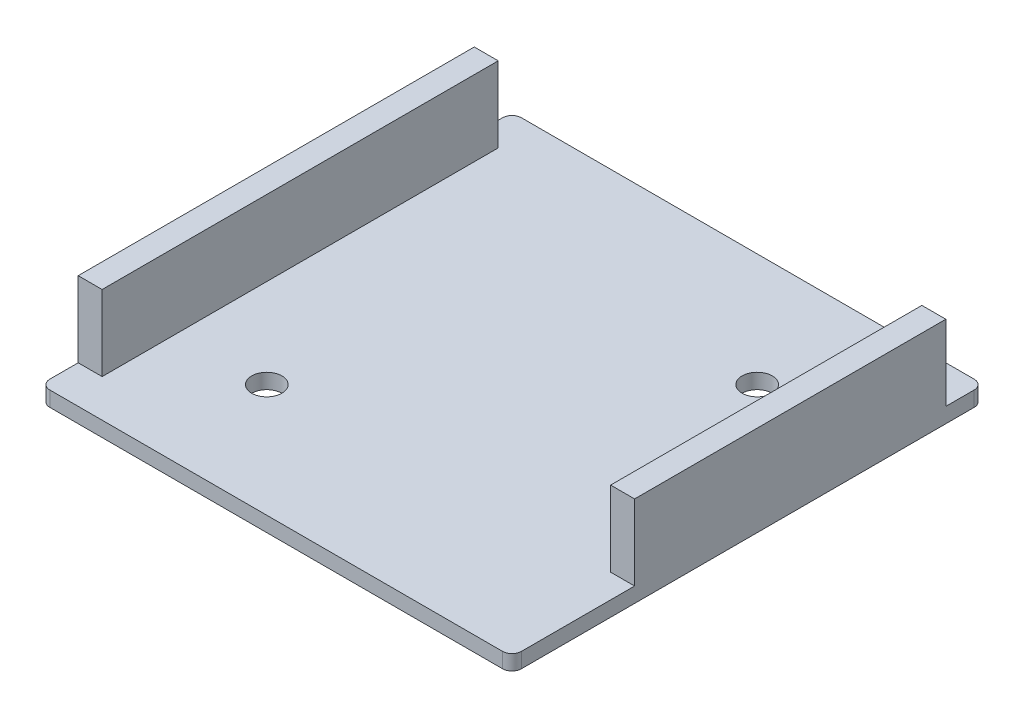
ISO-10303-21;
HEADER;
FILE_DESCRIPTION(('STEP AP214'),'2;1');
FILE_NAME('part.step','',(''),(''),'','','');
FILE_SCHEMA(('AUTOMOTIVE_DESIGN { 1 0 10303 214 1 1 1 1 }'));
ENDSEC;
DATA;
#1=APPLICATION_CONTEXT('core data for automotive mechanical design processes');
#2=APPLICATION_PROTOCOL_DEFINITION('international standard','automotive_design',2000,#1);
#3=PRODUCT_CONTEXT('',#1,'mechanical');
#4=PRODUCT('Part','Part','',(#3));
#5=PRODUCT_RELATED_PRODUCT_CATEGORY('part','',(#4));
#6=PRODUCT_DEFINITION_FORMATION('','',#4);
#7=PRODUCT_DEFINITION_CONTEXT('part definition',#1,'design');
#8=PRODUCT_DEFINITION('design','',#6,#7);
#9=PRODUCT_DEFINITION_SHAPE('','',#8);
#10=(LENGTH_UNIT() NAMED_UNIT(*) SI_UNIT(.MILLI.,.METRE.));
#11=(NAMED_UNIT(*) PLANE_ANGLE_UNIT() SI_UNIT($,.RADIAN.));
#12=(NAMED_UNIT(*) SI_UNIT($,.STERADIAN.) SOLID_ANGLE_UNIT());
#13=UNCERTAINTY_MEASURE_WITH_UNIT(LENGTH_MEASURE(1.E-05),#10,'distance_accuracy_value','');
#14=(GEOMETRIC_REPRESENTATION_CONTEXT(3) GLOBAL_UNCERTAINTY_ASSIGNED_CONTEXT((#13)) GLOBAL_UNIT_ASSIGNED_CONTEXT((#10,
#11,#12)) REPRESENTATION_CONTEXT('',''));
#15=CARTESIAN_POINT('',(0.,0.,0.));
#16=DIRECTION('',(0.,0.,1.));
#17=DIRECTION('',(1.,0.,0.));
#18=AXIS2_PLACEMENT_3D('',#15,#16,#17);
#19=CARTESIAN_POINT('',(0.,1.6,0.));
#20=DIRECTION('',(0.,-1.,0.));
#21=DIRECTION('',(0.,0.,-1.));
#22=AXIS2_PLACEMENT_3D('',#19,#20,#21);
#23=PLANE('',#22);
#24=CARTESIAN_POINT('',(13.,1.6,-13.));
#25=DIRECTION('',(0.,1.,0.));
#26=DIRECTION('',(0.,0.,1.));
#27=AXIS2_PLACEMENT_3D('',#24,#25,#26);
#28=CIRCLE('',#27,1.6);
#29=CARTESIAN_POINT('',(13.,1.6,-11.4));
#30=VERTEX_POINT('',#29);
#31=EDGE_CURVE('E216',#30,#30,#28,.T.);
#32=ORIENTED_EDGE('',*,*,#31,.F.);
#33=EDGE_LOOP('',(#32));
#34=FACE_BOUND('',#33,.T.);
#35=CARTESIAN_POINT('',(-13.,1.6,13.));
#36=DIRECTION('',(0.,1.,0.));
#37=DIRECTION('',(0.,0.,1.));
#38=AXIS2_PLACEMENT_3D('',#35,#36,#37);
#39=CIRCLE('',#38,1.6);
#40=CARTESIAN_POINT('',(-13.,1.6,14.6));
#41=VERTEX_POINT('',#40);
#42=EDGE_CURVE('E221',#41,#41,#39,.T.);
#43=ORIENTED_EDGE('',*,*,#42,.F.);
#44=EDGE_LOOP('',(#43));
#45=FACE_BOUND('',#44,.T.);
#46=DIRECTION('',(1.,0.,0.));
#47=VECTOR('',#46,1.);
#48=CARTESIAN_POINT('',(22.46,1.6,12.));
#49=LINE('',#48,#47);
#50=CARTESIAN_POINT('',(22.46,1.6,12.));
#51=VERTEX_POINT('',#50);
#52=CARTESIAN_POINT('',(25.,1.6,12.));
#53=VERTEX_POINT('',#52);
#54=EDGE_CURVE('E50',#51,#53,#49,.T.);
#55=ORIENTED_EDGE('',*,*,#54,.F.);
#56=DIRECTION('',(0.,0.,1.));
#57=VECTOR('',#56,1.);
#58=CARTESIAN_POINT('',(22.46,1.6,-21.));
#59=LINE('',#58,#57);
#60=CARTESIAN_POINT('',(22.46,1.6,-21.));
#61=VERTEX_POINT('',#60);
#62=EDGE_CURVE('E55',#61,#51,#59,.T.);
#63=ORIENTED_EDGE('',*,*,#62,.F.);
#64=DIRECTION('',(-1.,0.,0.));
#65=VECTOR('',#64,1.);
#66=CARTESIAN_POINT('',(22.46,1.6,-21.));
#67=LINE('',#66,#65);
#68=CARTESIAN_POINT('',(25.,1.6,-21.));
#69=VERTEX_POINT('',#68);
#70=EDGE_CURVE('E166',#69,#61,#67,.T.);
#71=ORIENTED_EDGE('',*,*,#70,.F.);
#72=DIRECTION('',(0.,0.,-1.));
#73=VECTOR('',#72,1.);
#74=CARTESIAN_POINT('',(25.,1.6,-25.));
#75=LINE('',#74,#73);
#76=CARTESIAN_POINT('',(25.,1.6,-24.));
#77=VERTEX_POINT('',#76);
#78=EDGE_CURVE('E288',#69,#77,#75,.T.);
#79=ORIENTED_EDGE('',*,*,#78,.T.);
#80=CARTESIAN_POINT('',(24.,1.6,-24.));
#81=DIRECTION('',(0.,-1.,0.));
#82=DIRECTION('',(0.,0.,-1.));
#83=AXIS2_PLACEMENT_3D('',#80,#81,#82);
#84=CIRCLE('',#83,1.);
#85=CARTESIAN_POINT('',(24.,1.6,-25.));
#86=VERTEX_POINT('',#85);
#87=EDGE_CURVE('E249',#77,#86,#84,.F.);
#88=ORIENTED_EDGE('',*,*,#87,.T.);
#89=DIRECTION('',(-1.,0.,0.));
#90=VECTOR('',#89,1.);
#91=CARTESIAN_POINT('',(25.,1.6,-25.));
#92=LINE('',#91,#90);
#93=CARTESIAN_POINT('',(-24.,1.6,-25.));
#94=VERTEX_POINT('',#93);
#95=EDGE_CURVE('E274',#86,#94,#92,.T.);
#96=ORIENTED_EDGE('',*,*,#95,.T.);
#97=CARTESIAN_POINT('',(-24.,1.6,-24.));
#98=DIRECTION('',(0.,-1.,0.));
#99=DIRECTION('',(0.,0.,-1.));
#100=AXIS2_PLACEMENT_3D('',#97,#98,#99);
#101=CIRCLE('',#100,1.);
#102=CARTESIAN_POINT('',(-25.,1.6,-24.));
#103=VERTEX_POINT('',#102);
#104=EDGE_CURVE('E251',#94,#103,#101,.F.);
#105=ORIENTED_EDGE('',*,*,#104,.T.);
#106=DIRECTION('',(0.,0.,1.));
#107=VECTOR('',#106,1.);
#108=CARTESIAN_POINT('',(-25.,1.6,-25.));
#109=LINE('',#108,#107);
#110=CARTESIAN_POINT('',(-25.,1.6,-21.));
#111=VERTEX_POINT('',#110);
#112=EDGE_CURVE('E238',#103,#111,#109,.T.);
#113=ORIENTED_EDGE('',*,*,#112,.T.);
#114=DIRECTION('',(-1.,0.,0.));
#115=VECTOR('',#114,1.);
#116=CARTESIAN_POINT('',(-25.,1.6,-21.));
#117=LINE('',#116,#115);
#118=CARTESIAN_POINT('',(-22.46,1.6,-21.));
#119=VERTEX_POINT('',#118);
#120=EDGE_CURVE('E182',#119,#111,#117,.T.);
#121=ORIENTED_EDGE('',*,*,#120,.F.);
#122=DIRECTION('',(0.,0.,-1.));
#123=VECTOR('',#122,1.);
#124=CARTESIAN_POINT('',(-22.46,1.6,-21.));
#125=LINE('',#124,#123);
#126=CARTESIAN_POINT('',(-22.46,1.6,21.));
#127=VERTEX_POINT('',#126);
#128=EDGE_CURVE('E172',#127,#119,#125,.T.);
#129=ORIENTED_EDGE('',*,*,#128,.F.);
#130=DIRECTION('',(1.,0.,0.));
#131=VECTOR('',#130,1.);
#132=CARTESIAN_POINT('',(-25.,1.6,21.));
#133=LINE('',#132,#131);
#134=CARTESIAN_POINT('',(-25.,1.6,21.));
#135=VERTEX_POINT('',#134);
#136=EDGE_CURVE('E169',#135,#127,#133,.T.);
#137=ORIENTED_EDGE('',*,*,#136,.F.);
#138=CARTESIAN_POINT('',(-25.,1.6,24.));
#139=VERTEX_POINT('',#138);
#140=EDGE_CURVE('E236',#135,#139,#109,.T.);
#141=ORIENTED_EDGE('',*,*,#140,.T.);
#142=CARTESIAN_POINT('',(-24.,1.6,24.));
#143=DIRECTION('',(0.,-1.,0.));
#144=DIRECTION('',(0.,0.,-1.));
#145=AXIS2_PLACEMENT_3D('',#142,#143,#144);
#146=CIRCLE('',#145,1.);
#147=CARTESIAN_POINT('',(-24.,1.6,25.));
#148=VERTEX_POINT('',#147);
#149=EDGE_CURVE('E253',#139,#148,#146,.F.);
#150=ORIENTED_EDGE('',*,*,#149,.T.);
#151=DIRECTION('',(1.,0.,0.));
#152=VECTOR('',#151,1.);
#153=CARTESIAN_POINT('',(25.,1.6,25.));
#154=LINE('',#153,#152);
#155=CARTESIAN_POINT('',(24.,1.6,25.));
#156=VERTEX_POINT('',#155);
#157=EDGE_CURVE('E232',#148,#156,#154,.T.);
#158=ORIENTED_EDGE('',*,*,#157,.T.);
#159=CARTESIAN_POINT('',(24.,1.6,24.));
#160=DIRECTION('',(0.,-1.,0.));
#161=DIRECTION('',(0.,0.,-1.));
#162=AXIS2_PLACEMENT_3D('',#159,#160,#161);
#163=CIRCLE('',#162,1.);
#164=CARTESIAN_POINT('',(25.,1.6,24.));
#165=VERTEX_POINT('',#164);
#166=EDGE_CURVE('E247',#156,#165,#163,.F.);
#167=ORIENTED_EDGE('',*,*,#166,.T.);
#168=EDGE_CURVE('E287',#165,#53,#75,.T.);
#169=ORIENTED_EDGE('',*,*,#168,.T.);
#170=EDGE_LOOP('',(#55,#63,#71,#79,#88,#96,#105,#113,#121,#129,#137,#141,#150,#158,#167,#169));
#171=FACE_BOUND('',#170,.T.);
#172=ADVANCED_FACE('F33',(#34,#45,#171),#23,.F.);
#173=CARTESIAN_POINT('',(-25.,1.6,-25.));
#174=DIRECTION('',(1.,0.,0.));
#175=DIRECTION('',(0.,0.,-1.));
#176=AXIS2_PLACEMENT_3D('',#173,#174,#175);
#177=PLANE('',#176);
#178=ORIENTED_EDGE('',*,*,#112,.F.);
#179=DIRECTION('',(0.,-1.,0.));
#180=VECTOR('',#179,1.);
#181=CARTESIAN_POINT('',(-25.,1.6,-24.));
#182=LINE('',#181,#180);
#183=CARTESIAN_POINT('',(-25.,0.,-24.));
#184=VERTEX_POINT('',#183);
#185=EDGE_CURVE('E11',#103,#184,#182,.T.);
#186=ORIENTED_EDGE('',*,*,#185,.T.);
#187=DIRECTION('',(0.,0.,1.));
#188=VECTOR('',#187,1.);
#189=CARTESIAN_POINT('',(-25.,0.,-25.));
#190=LINE('',#189,#188);
#191=CARTESIAN_POINT('',(-25.,0.,24.));
#192=VERTEX_POINT('',#191);
#193=EDGE_CURVE('E227',#184,#192,#190,.T.);
#194=ORIENTED_EDGE('',*,*,#193,.T.);
#195=DIRECTION('',(0.,-1.,0.));
#196=VECTOR('',#195,1.);
#197=CARTESIAN_POINT('',(-25.,1.6,24.));
#198=LINE('',#197,#196);
#199=EDGE_CURVE('E42',#192,#139,#198,.F.);
#200=ORIENTED_EDGE('',*,*,#199,.T.);
#201=ORIENTED_EDGE('',*,*,#140,.F.);
#202=DIRECTION('',(0.,-1.,0.));
#203=VECTOR('',#202,1.);
#204=CARTESIAN_POINT('',(-25.,9.6,21.));
#205=LINE('',#204,#203);
#206=CARTESIAN_POINT('',(-25.,9.6,21.));
#207=VERTEX_POINT('',#206);
#208=EDGE_CURVE('E211',#207,#135,#205,.T.);
#209=ORIENTED_EDGE('',*,*,#208,.F.);
#210=DIRECTION('',(0.,0.,1.));
#211=VECTOR('',#210,1.);
#212=CARTESIAN_POINT('',(-25.,9.6,-21.));
#213=LINE('',#212,#211);
#214=CARTESIAN_POINT('',(-25.,9.6,-21.));
#215=VERTEX_POINT('',#214);
#216=EDGE_CURVE('E178',#215,#207,#213,.T.);
#217=ORIENTED_EDGE('',*,*,#216,.F.);
#218=DIRECTION('',(0.,-1.,0.));
#219=VECTOR('',#218,1.);
#220=CARTESIAN_POINT('',(-25.,9.6,-21.));
#221=LINE('',#220,#219);
#222=EDGE_CURVE('E188',#215,#111,#221,.T.);
#223=ORIENTED_EDGE('',*,*,#222,.T.);
#224=EDGE_LOOP('',(#178,#186,#194,#200,#201,#209,#217,#223));
#225=FACE_BOUND('',#224,.T.);
#226=ADVANCED_FACE('F321',(#225),#177,.F.);
#227=CARTESIAN_POINT('',(25.,1.6,25.));
#228=DIRECTION('',(0.,0.,-1.));
#229=DIRECTION('',(-1.,0.,0.));
#230=AXIS2_PLACEMENT_3D('',#227,#228,#229);
#231=PLANE('',#230);
#232=DIRECTION('',(1.,0.,0.));
#233=VECTOR('',#232,1.);
#234=CARTESIAN_POINT('',(25.,0.,25.));
#235=LINE('',#234,#233);
#236=CARTESIAN_POINT('',(-24.,0.,25.));
#237=VERTEX_POINT('',#236);
#238=CARTESIAN_POINT('',(24.,0.,25.));
#239=VERTEX_POINT('',#238);
#240=EDGE_CURVE('E281',#237,#239,#235,.T.);
#241=ORIENTED_EDGE('',*,*,#240,.T.);
#242=DIRECTION('',(0.,-1.,0.));
#243=VECTOR('',#242,1.);
#244=CARTESIAN_POINT('',(24.,1.6,25.));
#245=LINE('',#244,#243);
#246=EDGE_CURVE('E255',#239,#156,#245,.F.);
#247=ORIENTED_EDGE('',*,*,#246,.T.);
#248=ORIENTED_EDGE('',*,*,#157,.F.);
#249=DIRECTION('',(0.,-1.,0.));
#250=VECTOR('',#249,1.);
#251=CARTESIAN_POINT('',(-24.,1.6,25.));
#252=LINE('',#251,#250);
#253=EDGE_CURVE('E257',#148,#237,#252,.T.);
#254=ORIENTED_EDGE('',*,*,#253,.T.);
#255=EDGE_LOOP('',(#241,#247,#248,#254));
#256=FACE_BOUND('',#255,.T.);
#257=ADVANCED_FACE('F324',(#256),#231,.F.);
#258=CARTESIAN_POINT('',(25.,1.6,-25.));
#259=DIRECTION('',(-1.,0.,0.));
#260=DIRECTION('',(0.,0.,1.));
#261=AXIS2_PLACEMENT_3D('',#258,#259,#260);
#262=PLANE('',#261);
#263=ORIENTED_EDGE('',*,*,#168,.F.);
#264=DIRECTION('',(0.,-1.,0.));
#265=VECTOR('',#264,1.);
#266=CARTESIAN_POINT('',(25.,1.6,24.));
#267=LINE('',#266,#265);
#268=CARTESIAN_POINT('',(25.,0.,24.));
#269=VERTEX_POINT('',#268);
#270=EDGE_CURVE('E268',#165,#269,#267,.T.);
#271=ORIENTED_EDGE('',*,*,#270,.T.);
#272=DIRECTION('',(0.,0.,-1.));
#273=VECTOR('',#272,1.);
#274=CARTESIAN_POINT('',(25.,0.,-25.));
#275=LINE('',#274,#273);
#276=CARTESIAN_POINT('',(25.,0.,-24.));
#277=VERTEX_POINT('',#276);
#278=EDGE_CURVE('E278',#269,#277,#275,.T.);
#279=ORIENTED_EDGE('',*,*,#278,.T.);
#280=DIRECTION('',(0.,-1.,0.));
#281=VECTOR('',#280,1.);
#282=CARTESIAN_POINT('',(25.,1.6,-24.));
#283=LINE('',#282,#281);
#284=EDGE_CURVE('E271',#277,#77,#283,.F.);
#285=ORIENTED_EDGE('',*,*,#284,.T.);
#286=ORIENTED_EDGE('',*,*,#78,.F.);
#287=DIRECTION('',(0.,-1.,0.));
#288=VECTOR('',#287,1.);
#289=CARTESIAN_POINT('',(25.,9.6,-21.));
#290=LINE('',#289,#288);
#291=CARTESIAN_POINT('',(25.,9.6,-21.));
#292=VERTEX_POINT('',#291);
#293=EDGE_CURVE('E174',#292,#69,#290,.T.);
#294=ORIENTED_EDGE('',*,*,#293,.F.);
#295=DIRECTION('',(0.,0.,-1.));
#296=VECTOR('',#295,1.);
#297=CARTESIAN_POINT('',(25.,9.6,-21.));
#298=LINE('',#297,#296);
#299=CARTESIAN_POINT('',(25.,9.6,12.));
#300=VERTEX_POINT('',#299);
#301=EDGE_CURVE('E156',#300,#292,#298,.T.);
#302=ORIENTED_EDGE('',*,*,#301,.F.);
#303=DIRECTION('',(0.,-1.,0.));
#304=VECTOR('',#303,1.);
#305=CARTESIAN_POINT('',(25.,9.6,12.));
#306=LINE('',#305,#304);
#307=EDGE_CURVE('E153',#300,#53,#306,.T.);
#308=ORIENTED_EDGE('',*,*,#307,.T.);
#309=EDGE_LOOP('',(#263,#271,#279,#285,#286,#294,#302,#308));
#310=FACE_BOUND('',#309,.T.);
#311=ADVANCED_FACE('F302',(#310),#262,.F.);
#312=CARTESIAN_POINT('',(25.,1.6,-25.));
#313=DIRECTION('',(0.,0.,1.));
#314=DIRECTION('',(1.,0.,0.));
#315=AXIS2_PLACEMENT_3D('',#312,#313,#314);
#316=PLANE('',#315);
#317=ORIENTED_EDGE('',*,*,#95,.F.);
#318=DIRECTION('',(0.,-1.,0.));
#319=VECTOR('',#318,1.);
#320=CARTESIAN_POINT('',(24.,1.6,-25.));
#321=LINE('',#320,#319);
#322=CARTESIAN_POINT('',(24.,0.,-25.));
#323=VERTEX_POINT('',#322);
#324=EDGE_CURVE('E242',#86,#323,#321,.T.);
#325=ORIENTED_EDGE('',*,*,#324,.T.);
#326=DIRECTION('',(-1.,0.,0.));
#327=VECTOR('',#326,1.);
#328=CARTESIAN_POINT('',(25.,0.,-25.));
#329=LINE('',#328,#327);
#330=CARTESIAN_POINT('',(-24.,0.,-25.));
#331=VERTEX_POINT('',#330);
#332=EDGE_CURVE('E275',#323,#331,#329,.T.);
#333=ORIENTED_EDGE('',*,*,#332,.T.);
#334=DIRECTION('',(0.,-1.,0.));
#335=VECTOR('',#334,1.);
#336=CARTESIAN_POINT('',(-24.,1.6,-25.));
#337=LINE('',#336,#335);
#338=EDGE_CURVE('E245',#331,#94,#337,.F.);
#339=ORIENTED_EDGE('',*,*,#338,.T.);
#340=EDGE_LOOP('',(#317,#325,#333,#339));
#341=FACE_BOUND('',#340,.T.);
#342=ADVANCED_FACE('F314',(#341),#316,.F.);
#343=CARTESIAN_POINT('',(0.,0.,0.));
#344=DIRECTION('',(0.,-1.,0.));
#345=DIRECTION('',(0.,0.,-1.));
#346=AXIS2_PLACEMENT_3D('',#343,#344,#345);
#347=PLANE('',#346);
#348=CARTESIAN_POINT('',(13.,0.,-13.));
#349=DIRECTION('',(0.,1.,0.));
#350=DIRECTION('',(0.,0.,1.));
#351=AXIS2_PLACEMENT_3D('',#348,#349,#350);
#352=CIRCLE('',#351,1.6);
#353=CARTESIAN_POINT('',(13.,0.,-11.4));
#354=VERTEX_POINT('',#353);
#355=EDGE_CURVE('E218',#354,#354,#352,.T.);
#356=ORIENTED_EDGE('',*,*,#355,.T.);
#357=EDGE_LOOP('',(#356));
#358=FACE_BOUND('',#357,.T.);
#359=CARTESIAN_POINT('',(-13.,0.,13.));
#360=DIRECTION('',(0.,1.,0.));
#361=DIRECTION('',(0.,0.,1.));
#362=AXIS2_PLACEMENT_3D('',#359,#360,#361);
#363=CIRCLE('',#362,1.6);
#364=CARTESIAN_POINT('',(-13.,0.,14.6));
#365=VERTEX_POINT('',#364);
#366=EDGE_CURVE('E224',#365,#365,#363,.T.);
#367=ORIENTED_EDGE('',*,*,#366,.T.);
#368=EDGE_LOOP('',(#367));
#369=FACE_BOUND('',#368,.T.);
#370=ORIENTED_EDGE('',*,*,#278,.F.);
#371=CARTESIAN_POINT('',(24.,0.,24.));
#372=DIRECTION('',(0.,-1.,0.));
#373=DIRECTION('',(0.,0.,-1.));
#374=AXIS2_PLACEMENT_3D('',#371,#372,#373);
#375=CIRCLE('',#374,1.);
#376=EDGE_CURVE('E260',#269,#239,#375,.T.);
#377=ORIENTED_EDGE('',*,*,#376,.T.);
#378=ORIENTED_EDGE('',*,*,#240,.F.);
#379=CARTESIAN_POINT('',(-24.,0.,24.));
#380=DIRECTION('',(0.,-1.,0.));
#381=DIRECTION('',(0.,0.,-1.));
#382=AXIS2_PLACEMENT_3D('',#379,#380,#381);
#383=CIRCLE('',#382,1.);
#384=EDGE_CURVE('E266',#237,#192,#383,.T.);
#385=ORIENTED_EDGE('',*,*,#384,.T.);
#386=ORIENTED_EDGE('',*,*,#193,.F.);
#387=CARTESIAN_POINT('',(-24.,0.,-24.));
#388=DIRECTION('',(0.,-1.,0.));
#389=DIRECTION('',(0.,0.,-1.));
#390=AXIS2_PLACEMENT_3D('',#387,#388,#389);
#391=CIRCLE('',#390,1.);
#392=EDGE_CURVE('E264',#184,#331,#391,.T.);
#393=ORIENTED_EDGE('',*,*,#392,.T.);
#394=ORIENTED_EDGE('',*,*,#332,.F.);
#395=CARTESIAN_POINT('',(24.,0.,-24.));
#396=DIRECTION('',(0.,-1.,0.));
#397=DIRECTION('',(0.,0.,-1.));
#398=AXIS2_PLACEMENT_3D('',#395,#396,#397);
#399=CIRCLE('',#398,1.);
#400=EDGE_CURVE('E262',#323,#277,#399,.T.);
#401=ORIENTED_EDGE('',*,*,#400,.T.);
#402=EDGE_LOOP('',(#370,#377,#378,#385,#386,#393,#394,#401));
#403=FACE_BOUND('',#402,.T.);
#404=ADVANCED_FACE('F305',(#358,#369,#403),#347,.T.);
#405=CARTESIAN_POINT('',(-13.,0.,13.));
#406=DIRECTION('',(0.,1.,0.));
#407=DIRECTION('',(0.,0.,1.));
#408=AXIS2_PLACEMENT_3D('',#405,#406,#407);
#409=CYLINDRICAL_SURFACE('',#408,1.6);
#410=ORIENTED_EDGE('',*,*,#366,.F.);
#411=EDGE_LOOP('',(#410));
#412=FACE_BOUND('',#411,.T.);
#413=ORIENTED_EDGE('',*,*,#42,.T.);
#414=EDGE_LOOP('',(#413));
#415=FACE_BOUND('',#414,.T.);
#416=ADVANCED_FACE('F342',(#412,#415),#409,.F.);
#417=CARTESIAN_POINT('',(13.,0.,-13.));
#418=DIRECTION('',(0.,1.,0.));
#419=DIRECTION('',(0.,0.,1.));
#420=AXIS2_PLACEMENT_3D('',#417,#418,#419);
#421=CYLINDRICAL_SURFACE('',#420,1.6);
#422=ORIENTED_EDGE('',*,*,#355,.F.);
#423=EDGE_LOOP('',(#422));
#424=FACE_BOUND('',#423,.T.);
#425=ORIENTED_EDGE('',*,*,#31,.T.);
#426=EDGE_LOOP('',(#425));
#427=FACE_BOUND('',#426,.T.);
#428=ADVANCED_FACE('F363',(#424,#427),#421,.F.);
#429=CARTESIAN_POINT('',(24.,1.6,24.));
#430=DIRECTION('',(0.,-1.,0.));
#431=DIRECTION('',(0.,0.,-1.));
#432=AXIS2_PLACEMENT_3D('',#429,#430,#431);
#433=CYLINDRICAL_SURFACE('',#432,1.);
#434=ORIENTED_EDGE('',*,*,#166,.F.);
#435=ORIENTED_EDGE('',*,*,#246,.F.);
#436=ORIENTED_EDGE('',*,*,#376,.F.);
#437=ORIENTED_EDGE('',*,*,#270,.F.);
#438=EDGE_LOOP('',(#434,#435,#436,#437));
#439=FACE_BOUND('',#438,.T.);
#440=ADVANCED_FACE('F299',(#439),#433,.T.);
#441=CARTESIAN_POINT('',(24.,1.6,-24.));
#442=DIRECTION('',(0.,-1.,0.));
#443=DIRECTION('',(0.,0.,-1.));
#444=AXIS2_PLACEMENT_3D('',#441,#442,#443);
#445=CYLINDRICAL_SURFACE('',#444,1.);
#446=ORIENTED_EDGE('',*,*,#87,.F.);
#447=ORIENTED_EDGE('',*,*,#284,.F.);
#448=ORIENTED_EDGE('',*,*,#400,.F.);
#449=ORIENTED_EDGE('',*,*,#324,.F.);
#450=EDGE_LOOP('',(#446,#447,#448,#449));
#451=FACE_BOUND('',#450,.T.);
#452=ADVANCED_FACE('F311',(#451),#445,.T.);
#453=CARTESIAN_POINT('',(-24.,1.6,-24.));
#454=DIRECTION('',(0.,-1.,0.));
#455=DIRECTION('',(0.,0.,-1.));
#456=AXIS2_PLACEMENT_3D('',#453,#454,#455);
#457=CYLINDRICAL_SURFACE('',#456,1.);
#458=ORIENTED_EDGE('',*,*,#104,.F.);
#459=ORIENTED_EDGE('',*,*,#338,.F.);
#460=ORIENTED_EDGE('',*,*,#392,.F.);
#461=ORIENTED_EDGE('',*,*,#185,.F.);
#462=EDGE_LOOP('',(#458,#459,#460,#461));
#463=FACE_BOUND('',#462,.T.);
#464=ADVANCED_FACE('F319',(#463),#457,.T.);
#465=CARTESIAN_POINT('',(-24.,1.6,24.));
#466=DIRECTION('',(0.,-1.,0.));
#467=DIRECTION('',(0.,0.,-1.));
#468=AXIS2_PLACEMENT_3D('',#465,#466,#467);
#469=CYLINDRICAL_SURFACE('',#468,1.);
#470=ORIENTED_EDGE('',*,*,#149,.F.);
#471=ORIENTED_EDGE('',*,*,#199,.F.);
#472=ORIENTED_EDGE('',*,*,#384,.F.);
#473=ORIENTED_EDGE('',*,*,#253,.F.);
#474=EDGE_LOOP('',(#470,#471,#472,#473));
#475=FACE_BOUND('',#474,.T.);
#476=ADVANCED_FACE('F35',(#475),#469,.T.);
#477=CARTESIAN_POINT('',(-25.,9.6,21.));
#478=DIRECTION('',(0.,0.,-1.));
#479=DIRECTION('',(-1.,0.,0.));
#480=AXIS2_PLACEMENT_3D('',#477,#478,#479);
#481=PLANE('',#480);
#482=ORIENTED_EDGE('',*,*,#136,.T.);
#483=DIRECTION('',(0.,-1.,0.));
#484=VECTOR('',#483,1.);
#485=CARTESIAN_POINT('',(-22.46,9.6,21.));
#486=LINE('',#485,#484);
#487=CARTESIAN_POINT('',(-22.46,9.6,21.));
#488=VERTEX_POINT('',#487);
#489=EDGE_CURVE('E206',#488,#127,#486,.T.);
#490=ORIENTED_EDGE('',*,*,#489,.F.);
#491=DIRECTION('',(1.,0.,0.));
#492=VECTOR('',#491,1.);
#493=CARTESIAN_POINT('',(-25.,9.6,21.));
#494=LINE('',#493,#492);
#495=EDGE_CURVE('E181',#207,#488,#494,.T.);
#496=ORIENTED_EDGE('',*,*,#495,.F.);
#497=ORIENTED_EDGE('',*,*,#208,.T.);
#498=EDGE_LOOP('',(#482,#490,#496,#497));
#499=FACE_BOUND('',#498,.T.);
#500=ADVANCED_FACE('F392',(#499),#481,.F.);
#501=CARTESIAN_POINT('',(-22.46,9.6,-21.));
#502=DIRECTION('',(-1.,0.,0.));
#503=DIRECTION('',(0.,0.,1.));
#504=AXIS2_PLACEMENT_3D('',#501,#502,#503);
#505=PLANE('',#504);
#506=ORIENTED_EDGE('',*,*,#128,.T.);
#507=DIRECTION('',(0.,-1.,0.));
#508=VECTOR('',#507,1.);
#509=CARTESIAN_POINT('',(-22.46,9.6,-21.));
#510=LINE('',#509,#508);
#511=CARTESIAN_POINT('',(-22.46,9.6,-21.));
#512=VERTEX_POINT('',#511);
#513=EDGE_CURVE('E193',#512,#119,#510,.T.);
#514=ORIENTED_EDGE('',*,*,#513,.F.);
#515=DIRECTION('',(0.,0.,-1.));
#516=VECTOR('',#515,1.);
#517=CARTESIAN_POINT('',(-22.46,9.6,-21.));
#518=LINE('',#517,#516);
#519=EDGE_CURVE('E184',#488,#512,#518,.T.);
#520=ORIENTED_EDGE('',*,*,#519,.F.);
#521=ORIENTED_EDGE('',*,*,#489,.T.);
#522=EDGE_LOOP('',(#506,#514,#520,#521));
#523=FACE_BOUND('',#522,.T.);
#524=ADVANCED_FACE('F398',(#523),#505,.F.);
#525=CARTESIAN_POINT('',(-25.,9.6,-21.));
#526=DIRECTION('',(0.,0.,1.));
#527=DIRECTION('',(1.,0.,0.));
#528=AXIS2_PLACEMENT_3D('',#525,#526,#527);
#529=PLANE('',#528);
#530=ORIENTED_EDGE('',*,*,#120,.T.);
#531=ORIENTED_EDGE('',*,*,#222,.F.);
#532=DIRECTION('',(-1.,0.,0.));
#533=VECTOR('',#532,1.);
#534=CARTESIAN_POINT('',(-25.,9.6,-21.));
#535=LINE('',#534,#533);
#536=EDGE_CURVE('E186',#512,#215,#535,.T.);
#537=ORIENTED_EDGE('',*,*,#536,.F.);
#538=ORIENTED_EDGE('',*,*,#513,.T.);
#539=EDGE_LOOP('',(#530,#531,#537,#538));
#540=FACE_BOUND('',#539,.T.);
#541=ADVANCED_FACE('F406',(#540),#529,.F.);
#542=CARTESIAN_POINT('',(0.,9.6,0.));
#543=DIRECTION('',(0.,1.,0.));
#544=DIRECTION('',(0.,0.,1.));
#545=AXIS2_PLACEMENT_3D('',#542,#543,#544);
#546=PLANE('',#545);
#547=ORIENTED_EDGE('',*,*,#216,.T.);
#548=ORIENTED_EDGE('',*,*,#495,.T.);
#549=ORIENTED_EDGE('',*,*,#519,.T.);
#550=ORIENTED_EDGE('',*,*,#536,.T.);
#551=EDGE_LOOP('',(#547,#548,#549,#550));
#552=FACE_BOUND('',#551,.T.);
#553=ADVANCED_FACE('F413',(#552),#546,.T.);
#554=CARTESIAN_POINT('',(22.46,9.6,-21.));
#555=DIRECTION('',(1.,0.,0.));
#556=DIRECTION('',(0.,0.,-1.));
#557=AXIS2_PLACEMENT_3D('',#554,#555,#556);
#558=PLANE('',#557);
#559=ORIENTED_EDGE('',*,*,#62,.T.);
#560=DIRECTION('',(0.,-1.,0.));
#561=VECTOR('',#560,1.);
#562=CARTESIAN_POINT('',(22.46,9.6,12.));
#563=LINE('',#562,#561);
#564=CARTESIAN_POINT('',(22.46,9.6,12.));
#565=VERTEX_POINT('',#564);
#566=EDGE_CURVE('E151',#565,#51,#563,.T.);
#567=ORIENTED_EDGE('',*,*,#566,.F.);
#568=DIRECTION('',(0.,0.,1.));
#569=VECTOR('',#568,1.);
#570=CARTESIAN_POINT('',(22.46,9.6,-21.));
#571=LINE('',#570,#569);
#572=CARTESIAN_POINT('',(22.46,9.6,-21.));
#573=VERTEX_POINT('',#572);
#574=EDGE_CURVE('E157',#573,#565,#571,.T.);
#575=ORIENTED_EDGE('',*,*,#574,.F.);
#576=DIRECTION('',(0.,-1.,0.));
#577=VECTOR('',#576,1.);
#578=CARTESIAN_POINT('',(22.46,9.6,-21.));
#579=LINE('',#578,#577);
#580=EDGE_CURVE('E506',#573,#61,#579,.T.);
#581=ORIENTED_EDGE('',*,*,#580,.T.);
#582=EDGE_LOOP('',(#559,#567,#575,#581));
#583=FACE_BOUND('',#582,.T.);
#584=ADVANCED_FACE('F168',(#583),#558,.F.);
#585=CARTESIAN_POINT('',(22.46,9.6,12.));
#586=DIRECTION('',(0.,0.,-1.));
#587=DIRECTION('',(-1.,0.,0.));
#588=AXIS2_PLACEMENT_3D('',#585,#586,#587);
#589=PLANE('',#588);
#590=ORIENTED_EDGE('',*,*,#54,.T.);
#591=ORIENTED_EDGE('',*,*,#307,.F.);
#592=DIRECTION('',(1.,0.,0.));
#593=VECTOR('',#592,1.);
#594=CARTESIAN_POINT('',(22.46,9.6,12.));
#595=LINE('',#594,#593);
#596=EDGE_CURVE('E147',#565,#300,#595,.T.);
#597=ORIENTED_EDGE('',*,*,#596,.F.);
#598=ORIENTED_EDGE('',*,*,#566,.T.);
#599=EDGE_LOOP('',(#590,#591,#597,#598));
#600=FACE_BOUND('',#599,.T.);
#601=ADVANCED_FACE('F149',(#600),#589,.F.);
#602=CARTESIAN_POINT('',(22.46,9.6,-21.));
#603=DIRECTION('',(0.,0.,1.));
#604=DIRECTION('',(1.,0.,0.));
#605=AXIS2_PLACEMENT_3D('',#602,#603,#604);
#606=PLANE('',#605);
#607=ORIENTED_EDGE('',*,*,#70,.T.);
#608=ORIENTED_EDGE('',*,*,#580,.F.);
#609=DIRECTION('',(-1.,0.,0.));
#610=VECTOR('',#609,1.);
#611=CARTESIAN_POINT('',(22.46,9.6,-21.));
#612=LINE('',#611,#610);
#613=EDGE_CURVE('E162',#292,#573,#612,.T.);
#614=ORIENTED_EDGE('',*,*,#613,.F.);
#615=ORIENTED_EDGE('',*,*,#293,.T.);
#616=EDGE_LOOP('',(#607,#608,#614,#615));
#617=FACE_BOUND('',#616,.T.);
#618=ADVANCED_FACE('F433',(#617),#606,.F.);
#619=CARTESIAN_POINT('',(0.,9.6,0.));
#620=DIRECTION('',(0.,1.,0.));
#621=DIRECTION('',(0.,0.,1.));
#622=AXIS2_PLACEMENT_3D('',#619,#620,#621);
#623=PLANE('',#622);
#624=ORIENTED_EDGE('',*,*,#574,.T.);
#625=ORIENTED_EDGE('',*,*,#596,.T.);
#626=ORIENTED_EDGE('',*,*,#301,.T.);
#627=ORIENTED_EDGE('',*,*,#613,.T.);
#628=EDGE_LOOP('',(#624,#625,#626,#627));
#629=FACE_BOUND('',#628,.T.);
#630=ADVANCED_FACE('F160',(#629),#623,.T.);
#631=CLOSED_SHELL('',(#172,#226,#257,#311,#342,#404,#416,#428,#440,#452,#464,#476,#500,#524,
#541,#553,#584,#601,#618,#630));
#632=MANIFOLD_SOLID_BREP('B2',#631);
#633=ADVANCED_BREP_SHAPE_REPRESENTATION('',(#18,#632),#14);
#634=SHAPE_DEFINITION_REPRESENTATION(#9,#633);
ENDSEC;
END-ISO-10303-21;
